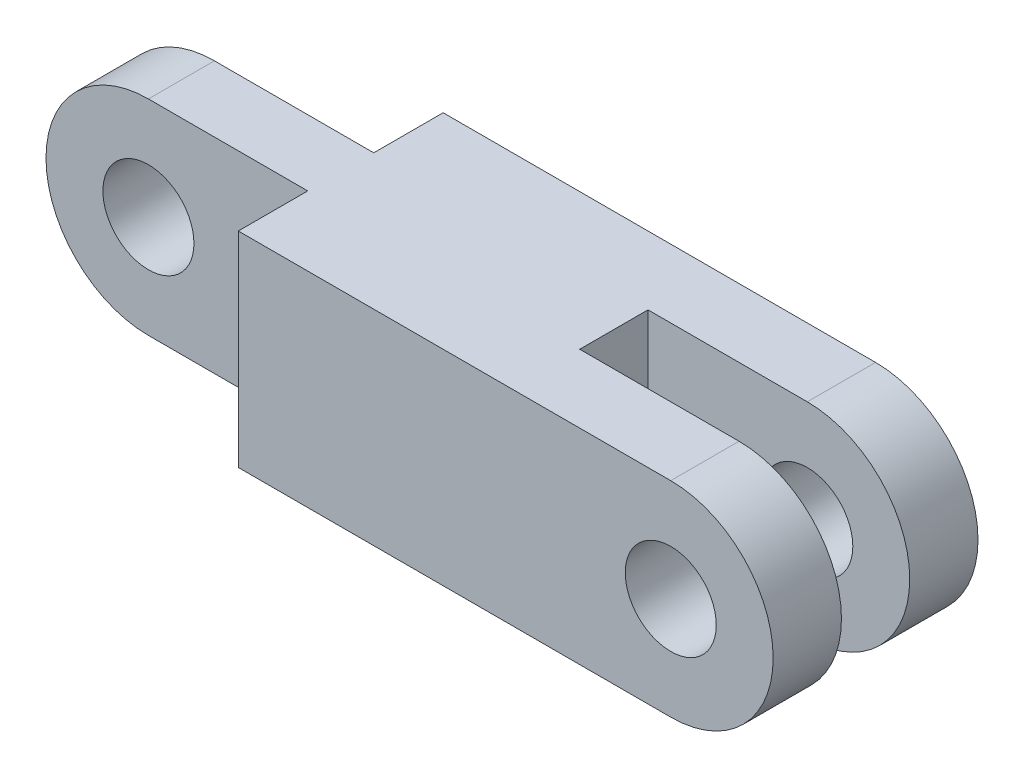
ISO-10303-21;
HEADER;
FILE_DESCRIPTION(('STEP AP214'),'2;1');
FILE_NAME('part.step','',(''),(''),'','','');
FILE_SCHEMA(('AUTOMOTIVE_DESIGN { 1 0 10303 214 1 1 1 1 }'));
ENDSEC;
DATA;
#1=APPLICATION_CONTEXT('core data for automotive mechanical design processes');
#2=APPLICATION_PROTOCOL_DEFINITION('international standard','automotive_design',2000,#1);
#3=PRODUCT_CONTEXT('',#1,'mechanical');
#4=PRODUCT('Part','Part','',(#3));
#5=PRODUCT_RELATED_PRODUCT_CATEGORY('part','',(#4));
#6=PRODUCT_DEFINITION_FORMATION('','',#4);
#7=PRODUCT_DEFINITION_CONTEXT('part definition',#1,'design');
#8=PRODUCT_DEFINITION('design','',#6,#7);
#9=PRODUCT_DEFINITION_SHAPE('','',#8);
#10=(LENGTH_UNIT() NAMED_UNIT(*) SI_UNIT(.MILLI.,.METRE.));
#11=(NAMED_UNIT(*) PLANE_ANGLE_UNIT() SI_UNIT($,.RADIAN.));
#12=(NAMED_UNIT(*) SI_UNIT($,.STERADIAN.) SOLID_ANGLE_UNIT());
#13=UNCERTAINTY_MEASURE_WITH_UNIT(LENGTH_MEASURE(1.E-05),#10,'distance_accuracy_value','');
#14=(GEOMETRIC_REPRESENTATION_CONTEXT(3) GLOBAL_UNCERTAINTY_ASSIGNED_CONTEXT((#13)) GLOBAL_UNIT_ASSIGNED_CONTEXT((#10,
#11,#12)) REPRESENTATION_CONTEXT('',''));
#15=CARTESIAN_POINT('',(0.,0.,0.));
#16=DIRECTION('',(0.,0.,1.));
#17=DIRECTION('',(1.,0.,0.));
#18=AXIS2_PLACEMENT_3D('',#15,#16,#17);
#19=CARTESIAN_POINT('',(0.,22.5,-7.25));
#20=DIRECTION('',(0.,1.,0.));
#21=DIRECTION('',(-1.,0.,0.));
#22=AXIS2_PLACEMENT_3D('',#19,#20,#21);
#23=PLANE('',#22);
#24=DIRECTION('',(0.,0.,1.));
#25=VECTOR('',#24,1.);
#26=CARTESIAN_POINT('',(-35.,22.5,-7.25));
#27=LINE('',#26,#25);
#28=CARTESIAN_POINT('',(-35.,22.5,-7.25));
#29=VERTEX_POINT('',#28);
#30=CARTESIAN_POINT('',(-35.,22.5,7.25));
#31=VERTEX_POINT('',#30);
#32=EDGE_CURVE('E36',#29,#31,#27,.T.);
#33=ORIENTED_EDGE('',*,*,#32,.T.);
#34=DIRECTION('',(-1.,0.,0.));
#35=VECTOR('',#34,1.);
#36=CARTESIAN_POINT('',(0.,22.5,7.25));
#37=LINE('',#36,#35);
#38=CARTESIAN_POINT('',(0.,22.5,7.25));
#39=VERTEX_POINT('',#38);
#40=EDGE_CURVE('E208',#39,#31,#37,.T.);
#41=ORIENTED_EDGE('',*,*,#40,.F.);
#42=DIRECTION('',(0.,0.,1.));
#43=VECTOR('',#42,1.);
#44=CARTESIAN_POINT('',(0.,22.5,22.5));
#45=LINE('',#44,#43);
#46=CARTESIAN_POINT('',(0.,22.5,22.5));
#47=VERTEX_POINT('',#46);
#48=EDGE_CURVE('E192',#39,#47,#45,.T.);
#49=ORIENTED_EDGE('',*,*,#48,.T.);
#50=DIRECTION('',(-1.,0.,0.));
#51=VECTOR('',#50,1.);
#52=CARTESIAN_POINT('',(60.,22.5,22.5));
#53=LINE('',#52,#51);
#54=CARTESIAN_POINT('',(95.,22.5,22.5));
#55=VERTEX_POINT('',#54);
#56=EDGE_CURVE('E136',#55,#47,#53,.T.);
#57=ORIENTED_EDGE('',*,*,#56,.F.);
#58=DIRECTION('',(0.,0.,-1.));
#59=VECTOR('',#58,1.);
#60=CARTESIAN_POINT('',(95.,22.5,22.5));
#61=LINE('',#60,#59);
#62=CARTESIAN_POINT('',(95.,22.5,7.5));
#63=VERTEX_POINT('',#62);
#64=EDGE_CURVE('E171',#55,#63,#61,.T.);
#65=ORIENTED_EDGE('',*,*,#64,.T.);
#66=DIRECTION('',(-1.,0.,0.));
#67=VECTOR('',#66,1.);
#68=CARTESIAN_POINT('',(95.,22.5,7.5));
#69=LINE('',#68,#67);
#70=CARTESIAN_POINT('',(60.,22.5,7.5));
#71=VERTEX_POINT('',#70);
#72=EDGE_CURVE('E165',#63,#71,#69,.T.);
#73=ORIENTED_EDGE('',*,*,#72,.T.);
#74=DIRECTION('',(0.,0.,1.));
#75=VECTOR('',#74,1.);
#76=CARTESIAN_POINT('',(60.,22.5,22.5));
#77=LINE('',#76,#75);
#78=CARTESIAN_POINT('',(60.,22.5,-7.49999999999999));
#79=VERTEX_POINT('',#78);
#80=EDGE_CURVE('E184',#79,#71,#77,.T.);
#81=ORIENTED_EDGE('',*,*,#80,.F.);
#82=DIRECTION('',(-1.,0.,0.));
#83=VECTOR('',#82,1.);
#84=CARTESIAN_POINT('',(95.,22.5,-7.5));
#85=LINE('',#84,#83);
#86=CARTESIAN_POINT('',(95.,22.5,-7.5));
#87=VERTEX_POINT('',#86);
#88=EDGE_CURVE('E47',#87,#79,#85,.T.);
#89=ORIENTED_EDGE('',*,*,#88,.F.);
#90=DIRECTION('',(0.,0.,1.));
#91=VECTOR('',#90,1.);
#92=CARTESIAN_POINT('',(95.,22.5,-22.5));
#93=LINE('',#92,#91);
#94=CARTESIAN_POINT('',(95.,22.5,-22.5));
#95=VERTEX_POINT('',#94);
#96=EDGE_CURVE('E138',#95,#87,#93,.T.);
#97=ORIENTED_EDGE('',*,*,#96,.F.);
#98=DIRECTION('',(-1.,0.,0.));
#99=VECTOR('',#98,1.);
#100=CARTESIAN_POINT('',(60.,22.5,-22.5));
#101=LINE('',#100,#99);
#102=CARTESIAN_POINT('',(0.,22.5,-22.5));
#103=VERTEX_POINT('',#102);
#104=EDGE_CURVE('E124',#95,#103,#101,.T.);
#105=ORIENTED_EDGE('',*,*,#104,.T.);
#106=CARTESIAN_POINT('',(0.,22.5,-7.24999999999999));
#107=VERTEX_POINT('',#106);
#108=EDGE_CURVE('E193',#103,#107,#45,.T.);
#109=ORIENTED_EDGE('',*,*,#108,.T.);
#110=DIRECTION('',(-1.,0.,0.));
#111=VECTOR('',#110,1.);
#112=CARTESIAN_POINT('',(0.,22.5,-7.25));
#113=LINE('',#112,#111);
#114=EDGE_CURVE('E221',#107,#29,#113,.T.);
#115=ORIENTED_EDGE('',*,*,#114,.T.);
#116=EDGE_LOOP('',(#33,#41,#49,#57,#65,#73,#81,#89,#97,#105,#109,#115));
#117=FACE_BOUND('',#116,.T.);
#118=ADVANCED_FACE('F33',(#117),#23,.T.);
#119=CARTESIAN_POINT('',(0.,-22.5,-7.25));
#120=DIRECTION('',(0.,-1.,0.));
#121=DIRECTION('',(1.,0.,0.));
#122=AXIS2_PLACEMENT_3D('',#119,#120,#121);
#123=PLANE('',#122);
#124=DIRECTION('',(1.,0.,0.));
#125=VECTOR('',#124,1.);
#126=CARTESIAN_POINT('',(0.,-22.5,-7.25));
#127=LINE('',#126,#125);
#128=CARTESIAN_POINT('',(-35.,-22.5,-7.25));
#129=VERTEX_POINT('',#128);
#130=CARTESIAN_POINT('',(0.,-22.5,-7.25));
#131=VERTEX_POINT('',#130);
#132=EDGE_CURVE('E227',#129,#131,#127,.T.);
#133=ORIENTED_EDGE('',*,*,#132,.T.);
#134=DIRECTION('',(0.,0.,-1.));
#135=VECTOR('',#134,1.);
#136=CARTESIAN_POINT('',(0.,-22.5,22.5));
#137=LINE('',#136,#135);
#138=CARTESIAN_POINT('',(0.,-22.5,-22.5));
#139=VERTEX_POINT('',#138);
#140=EDGE_CURVE('E197',#131,#139,#137,.T.);
#141=ORIENTED_EDGE('',*,*,#140,.T.);
#142=DIRECTION('',(-1.,0.,0.));
#143=VECTOR('',#142,1.);
#144=CARTESIAN_POINT('',(60.,-22.5,-22.5));
#145=LINE('',#144,#143);
#146=CARTESIAN_POINT('',(95.,-22.5,-22.5));
#147=VERTEX_POINT('',#146);
#148=EDGE_CURVE('E190',#147,#139,#145,.T.);
#149=ORIENTED_EDGE('',*,*,#148,.F.);
#150=DIRECTION('',(0.,0.,1.));
#151=VECTOR('',#150,1.);
#152=CARTESIAN_POINT('',(95.,-22.5,-22.5));
#153=LINE('',#152,#151);
#154=CARTESIAN_POINT('',(95.,-22.5,-7.5));
#155=VERTEX_POINT('',#154);
#156=EDGE_CURVE('E143',#147,#155,#153,.T.);
#157=ORIENTED_EDGE('',*,*,#156,.T.);
#158=DIRECTION('',(1.,0.,0.));
#159=VECTOR('',#158,1.);
#160=CARTESIAN_POINT('',(60.,-22.5,-7.5));
#161=LINE('',#160,#159);
#162=CARTESIAN_POINT('',(60.,-22.5,-7.5));
#163=VERTEX_POINT('',#162);
#164=EDGE_CURVE('E150',#163,#155,#161,.T.);
#165=ORIENTED_EDGE('',*,*,#164,.F.);
#166=DIRECTION('',(0.,0.,-1.));
#167=VECTOR('',#166,1.);
#168=CARTESIAN_POINT('',(60.,-22.5,22.5));
#169=LINE('',#168,#167);
#170=CARTESIAN_POINT('',(60.,-22.5,7.5));
#171=VERTEX_POINT('',#170);
#172=EDGE_CURVE('E186',#171,#163,#169,.T.);
#173=ORIENTED_EDGE('',*,*,#172,.F.);
#174=DIRECTION('',(1.,0.,0.));
#175=VECTOR('',#174,1.);
#176=CARTESIAN_POINT('',(60.,-22.5,7.5));
#177=LINE('',#176,#175);
#178=CARTESIAN_POINT('',(95.,-22.5,7.5));
#179=VERTEX_POINT('',#178);
#180=EDGE_CURVE('E55',#171,#179,#177,.T.);
#181=ORIENTED_EDGE('',*,*,#180,.T.);
#182=DIRECTION('',(0.,0.,-1.));
#183=VECTOR('',#182,1.);
#184=CARTESIAN_POINT('',(95.,-22.5,22.5));
#185=LINE('',#184,#183);
#186=CARTESIAN_POINT('',(95.,-22.5,22.5));
#187=VERTEX_POINT('',#186);
#188=EDGE_CURVE('E181',#187,#179,#185,.T.);
#189=ORIENTED_EDGE('',*,*,#188,.F.);
#190=DIRECTION('',(-1.,0.,0.));
#191=VECTOR('',#190,1.);
#192=CARTESIAN_POINT('',(60.,-22.5,22.5));
#193=LINE('',#192,#191);
#194=CARTESIAN_POINT('',(0.,-22.5,22.5));
#195=VERTEX_POINT('',#194);
#196=EDGE_CURVE('E201',#187,#195,#193,.T.);
#197=ORIENTED_EDGE('',*,*,#196,.T.);
#198=CARTESIAN_POINT('',(0.,-22.5,7.25));
#199=VERTEX_POINT('',#198);
#200=EDGE_CURVE('E187',#195,#199,#137,.T.);
#201=ORIENTED_EDGE('',*,*,#200,.T.);
#202=DIRECTION('',(1.,0.,0.));
#203=VECTOR('',#202,1.);
#204=CARTESIAN_POINT('',(0.,-22.5,7.25));
#205=LINE('',#204,#203);
#206=CARTESIAN_POINT('',(-35.,-22.5,7.25));
#207=VERTEX_POINT('',#206);
#208=EDGE_CURVE('E214',#207,#199,#205,.T.);
#209=ORIENTED_EDGE('',*,*,#208,.F.);
#210=DIRECTION('',(0.,0.,1.));
#211=VECTOR('',#210,1.);
#212=CARTESIAN_POINT('',(-35.,-22.5,-7.25));
#213=LINE('',#212,#211);
#214=EDGE_CURVE('E11',#129,#207,#213,.T.);
#215=ORIENTED_EDGE('',*,*,#214,.F.);
#216=EDGE_LOOP('',(#133,#141,#149,#157,#165,#173,#181,#189,#197,#201,#209,#215));
#217=FACE_BOUND('',#216,.T.);
#218=ADVANCED_FACE('F250',(#217),#123,.T.);
#219=CARTESIAN_POINT('',(-35.,0.,-7.25));
#220=DIRECTION('',(0.,0.,1.));
#221=DIRECTION('',(1.,0.,0.));
#222=AXIS2_PLACEMENT_3D('',#219,#220,#221);
#223=CYLINDRICAL_SURFACE('',#222,22.5);
#224=ORIENTED_EDGE('',*,*,#214,.T.);
#225=CARTESIAN_POINT('',(-35.,0.,7.25));
#226=DIRECTION('',(0.,0.,1.));
#227=DIRECTION('',(1.,0.,0.));
#228=AXIS2_PLACEMENT_3D('',#225,#226,#227);
#229=CIRCLE('',#228,22.5);
#230=EDGE_CURVE('E211',#31,#207,#229,.T.);
#231=ORIENTED_EDGE('',*,*,#230,.F.);
#232=ORIENTED_EDGE('',*,*,#32,.F.);
#233=CARTESIAN_POINT('',(-35.,0.,-7.25));
#234=DIRECTION('',(0.,0.,1.));
#235=DIRECTION('',(1.,0.,0.));
#236=AXIS2_PLACEMENT_3D('',#233,#234,#235);
#237=CIRCLE('',#236,22.5);
#238=EDGE_CURVE('E224',#29,#129,#237,.T.);
#239=ORIENTED_EDGE('',*,*,#238,.T.);
#240=EDGE_LOOP('',(#224,#231,#232,#239));
#241=FACE_BOUND('',#240,.T.);
#242=ADVANCED_FACE('F239',(#241),#223,.T.);
#243=CARTESIAN_POINT('',(-35.,0.,-7.25));
#244=DIRECTION('',(0.,0.,1.));
#245=DIRECTION('',(1.,0.,0.));
#246=AXIS2_PLACEMENT_3D('',#243,#244,#245);
#247=PLANE('',#246);
#248=CARTESIAN_POINT('',(-35.,0.,-7.25));
#249=DIRECTION('',(0.,0.,1.));
#250=DIRECTION('',(1.,0.,0.));
#251=AXIS2_PLACEMENT_3D('',#248,#249,#250);
#252=CIRCLE('',#251,10.);
#253=CARTESIAN_POINT('',(-25.,0.,-7.25));
#254=VERTEX_POINT('',#253);
#255=EDGE_CURVE('E218',#254,#254,#252,.T.);
#256=ORIENTED_EDGE('',*,*,#255,.T.);
#257=EDGE_LOOP('',(#256));
#258=FACE_BOUND('',#257,.T.);
#259=ORIENTED_EDGE('',*,*,#114,.F.);
#260=DIRECTION('',(0.,1.,0.));
#261=VECTOR('',#260,1.);
#262=CARTESIAN_POINT('',(0.,22.5,-7.25));
#263=LINE('',#262,#261);
#264=EDGE_CURVE('E229',#131,#107,#263,.T.);
#265=ORIENTED_EDGE('',*,*,#264,.F.);
#266=ORIENTED_EDGE('',*,*,#132,.F.);
#267=ORIENTED_EDGE('',*,*,#238,.F.);
#268=EDGE_LOOP('',(#259,#265,#266,#267));
#269=FACE_BOUND('',#268,.T.);
#270=ADVANCED_FACE('F286',(#258,#269),#247,.F.);
#271=CARTESIAN_POINT('',(-35.,0.,-7.25));
#272=DIRECTION('',(0.,0.,1.));
#273=DIRECTION('',(1.,0.,0.));
#274=AXIS2_PLACEMENT_3D('',#271,#272,#273);
#275=CYLINDRICAL_SURFACE('',#274,10.);
#276=ORIENTED_EDGE('',*,*,#255,.F.);
#277=EDGE_LOOP('',(#276));
#278=FACE_BOUND('',#277,.T.);
#279=CARTESIAN_POINT('',(-35.,0.,7.25));
#280=DIRECTION('',(0.,0.,1.));
#281=DIRECTION('',(1.,0.,0.));
#282=AXIS2_PLACEMENT_3D('',#279,#280,#281);
#283=CIRCLE('',#282,10.);
#284=CARTESIAN_POINT('',(-25.,0.,7.25));
#285=VERTEX_POINT('',#284);
#286=EDGE_CURVE('E135',#285,#285,#283,.T.);
#287=ORIENTED_EDGE('',*,*,#286,.T.);
#288=EDGE_LOOP('',(#287));
#289=FACE_BOUND('',#288,.T.);
#290=ADVANCED_FACE('F290',(#278,#289),#275,.F.);
#291=CARTESIAN_POINT('',(-35.,0.,7.25));
#292=DIRECTION('',(0.,0.,1.));
#293=DIRECTION('',(1.,0.,0.));
#294=AXIS2_PLACEMENT_3D('',#291,#292,#293);
#295=PLANE('',#294);
#296=ORIENTED_EDGE('',*,*,#40,.T.);
#297=ORIENTED_EDGE('',*,*,#230,.T.);
#298=ORIENTED_EDGE('',*,*,#208,.T.);
#299=DIRECTION('',(0.,1.,0.));
#300=VECTOR('',#299,1.);
#301=CARTESIAN_POINT('',(0.,22.5,7.25));
#302=LINE('',#301,#300);
#303=EDGE_CURVE('E216',#199,#39,#302,.T.);
#304=ORIENTED_EDGE('',*,*,#303,.T.);
#305=EDGE_LOOP('',(#296,#297,#298,#304));
#306=FACE_BOUND('',#305,.T.);
#307=ORIENTED_EDGE('',*,*,#286,.F.);
#308=EDGE_LOOP('',(#307));
#309=FACE_BOUND('',#308,.T.);
#310=ADVANCED_FACE('F242',(#306,#309),#295,.T.);
#311=CARTESIAN_POINT('',(0.,0.,0.));
#312=DIRECTION('',(-1.,0.,0.));
#313=DIRECTION('',(0.,-1.,0.));
#314=AXIS2_PLACEMENT_3D('',#311,#312,#313);
#315=PLANE('',#314);
#316=ORIENTED_EDGE('',*,*,#303,.F.);
#317=ORIENTED_EDGE('',*,*,#200,.F.);
#318=DIRECTION('',(0.,-1.,0.));
#319=VECTOR('',#318,1.);
#320=CARTESIAN_POINT('',(0.,-22.5,22.5));
#321=LINE('',#320,#319);
#322=EDGE_CURVE('E195',#47,#195,#321,.T.);
#323=ORIENTED_EDGE('',*,*,#322,.F.);
#324=ORIENTED_EDGE('',*,*,#48,.F.);
#325=EDGE_LOOP('',(#316,#317,#323,#324));
#326=FACE_BOUND('',#325,.T.);
#327=ADVANCED_FACE('F247',(#326),#315,.T.);
#328=CARTESIAN_POINT('',(60.,-22.5,-22.5));
#329=DIRECTION('',(0.,0.,1.));
#330=DIRECTION('',(1.,0.,0.));
#331=AXIS2_PLACEMENT_3D('',#328,#329,#330);
#332=PLANE('',#331);
#333=DIRECTION('',(0.,1.,0.));
#334=VECTOR('',#333,1.);
#335=CARTESIAN_POINT('',(0.,-22.5,-22.5));
#336=LINE('',#335,#334);
#337=EDGE_CURVE('E132',#139,#103,#336,.T.);
#338=ORIENTED_EDGE('',*,*,#337,.T.);
#339=ORIENTED_EDGE('',*,*,#104,.F.);
#340=CARTESIAN_POINT('',(95.,0.,-22.5));
#341=DIRECTION('',(0.,0.,1.));
#342=DIRECTION('',(-1.,0.,0.));
#343=AXIS2_PLACEMENT_3D('',#340,#341,#342);
#344=CIRCLE('',#343,22.5);
#345=EDGE_CURVE('E130',#147,#95,#344,.T.);
#346=ORIENTED_EDGE('',*,*,#345,.F.);
#347=ORIENTED_EDGE('',*,*,#148,.T.);
#348=EDGE_LOOP('',(#338,#339,#346,#347));
#349=FACE_BOUND('',#348,.T.);
#350=CARTESIAN_POINT('',(95.,0.,-22.5));
#351=DIRECTION('',(0.,0.,1.));
#352=DIRECTION('',(1.,0.,0.));
#353=AXIS2_PLACEMENT_3D('',#350,#351,#352);
#354=CIRCLE('',#353,9.99999999999999);
#355=CARTESIAN_POINT('',(105.,0.,-22.5));
#356=VERTEX_POINT('',#355);
#357=EDGE_CURVE('E158',#356,#356,#354,.T.);
#358=ORIENTED_EDGE('',*,*,#357,.T.);
#359=EDGE_LOOP('',(#358));
#360=FACE_BOUND('',#359,.T.);
#361=ADVANCED_FACE('F126',(#349,#360),#332,.F.);
#362=CARTESIAN_POINT('',(60.,-22.5,22.5));
#363=DIRECTION('',(0.,0.,-1.));
#364=DIRECTION('',(-1.,0.,0.));
#365=AXIS2_PLACEMENT_3D('',#362,#363,#364);
#366=PLANE('',#365);
#367=ORIENTED_EDGE('',*,*,#322,.T.);
#368=ORIENTED_EDGE('',*,*,#196,.F.);
#369=CARTESIAN_POINT('',(95.,0.,22.5));
#370=DIRECTION('',(0.,0.,1.));
#371=DIRECTION('',(-1.,0.,0.));
#372=AXIS2_PLACEMENT_3D('',#369,#370,#371);
#373=CIRCLE('',#372,22.5);
#374=EDGE_CURVE('E168',#187,#55,#373,.T.);
#375=ORIENTED_EDGE('',*,*,#374,.T.);
#376=ORIENTED_EDGE('',*,*,#56,.T.);
#377=EDGE_LOOP('',(#367,#368,#375,#376));
#378=FACE_BOUND('',#377,.T.);
#379=CARTESIAN_POINT('',(95.,0.,22.5));
#380=DIRECTION('',(0.,0.,1.));
#381=DIRECTION('',(1.,0.,0.));
#382=AXIS2_PLACEMENT_3D('',#379,#380,#381);
#383=CIRCLE('',#382,9.99999999999999);
#384=CARTESIAN_POINT('',(105.,0.,22.5));
#385=VERTEX_POINT('',#384);
#386=EDGE_CURVE('E162',#385,#385,#383,.T.);
#387=ORIENTED_EDGE('',*,*,#386,.F.);
#388=EDGE_LOOP('',(#387));
#389=FACE_BOUND('',#388,.T.);
#390=ADVANCED_FACE('F254',(#378,#389),#366,.F.);
#391=CARTESIAN_POINT('',(60.,0.,0.));
#392=DIRECTION('',(-1.,0.,0.));
#393=DIRECTION('',(0.,-1.,0.));
#394=AXIS2_PLACEMENT_3D('',#391,#392,#393);
#395=PLANE('',#394);
#396=ORIENTED_EDGE('',*,*,#172,.T.);
#397=DIRECTION('',(0.,-1.,0.));
#398=VECTOR('',#397,1.);
#399=CARTESIAN_POINT('',(60.,22.5,-7.5));
#400=LINE('',#399,#398);
#401=EDGE_CURVE('E147',#79,#163,#400,.T.);
#402=ORIENTED_EDGE('',*,*,#401,.F.);
#403=ORIENTED_EDGE('',*,*,#80,.T.);
#404=DIRECTION('',(0.,-1.,0.));
#405=VECTOR('',#404,1.);
#406=CARTESIAN_POINT('',(60.,22.5,7.5));
#407=LINE('',#406,#405);
#408=EDGE_CURVE('E175',#71,#171,#407,.T.);
#409=ORIENTED_EDGE('',*,*,#408,.T.);
#410=EDGE_LOOP('',(#396,#402,#403,#409));
#411=FACE_BOUND('',#410,.T.);
#412=ADVANCED_FACE('F263',(#411),#395,.F.);
#413=ORIENTED_EDGE('',*,*,#140,.F.);
#414=ORIENTED_EDGE('',*,*,#264,.T.);
#415=ORIENTED_EDGE('',*,*,#108,.F.);
#416=ORIENTED_EDGE('',*,*,#337,.F.);
#417=EDGE_LOOP('',(#413,#414,#415,#416));
#418=FACE_BOUND('',#417,.T.);
#419=ADVANCED_FACE('F301',(#418),#315,.T.);
#420=CARTESIAN_POINT('',(95.,0.,7.5));
#421=DIRECTION('',(0.,0.,-1.));
#422=DIRECTION('',(-1.,0.,0.));
#423=AXIS2_PLACEMENT_3D('',#420,#421,#422);
#424=PLANE('',#423);
#425=ORIENTED_EDGE('',*,*,#72,.F.);
#426=CARTESIAN_POINT('',(95.,0.,7.5));
#427=DIRECTION('',(0.,0.,1.));
#428=DIRECTION('',(-1.,0.,0.));
#429=AXIS2_PLACEMENT_3D('',#426,#427,#428);
#430=CIRCLE('',#429,22.5);
#431=EDGE_CURVE('E172',#179,#63,#430,.T.);
#432=ORIENTED_EDGE('',*,*,#431,.F.);
#433=ORIENTED_EDGE('',*,*,#180,.F.);
#434=ORIENTED_EDGE('',*,*,#408,.F.);
#435=EDGE_LOOP('',(#425,#432,#433,#434));
#436=FACE_BOUND('',#435,.T.);
#437=CARTESIAN_POINT('',(95.,0.,7.5));
#438=DIRECTION('',(0.,0.,1.));
#439=DIRECTION('',(1.,0.,0.));
#440=AXIS2_PLACEMENT_3D('',#437,#438,#439);
#441=CIRCLE('',#440,9.99999999999999);
#442=CARTESIAN_POINT('',(105.,0.,7.5));
#443=VERTEX_POINT('',#442);
#444=EDGE_CURVE('E142',#443,#443,#441,.T.);
#445=ORIENTED_EDGE('',*,*,#444,.T.);
#446=EDGE_LOOP('',(#445));
#447=FACE_BOUND('',#446,.T.);
#448=ADVANCED_FACE('F259',(#436,#447),#424,.T.);
#449=CARTESIAN_POINT('',(95.,0.,22.5));
#450=DIRECTION('',(0.,0.,-1.));
#451=DIRECTION('',(-1.,0.,0.));
#452=AXIS2_PLACEMENT_3D('',#449,#450,#451);
#453=CYLINDRICAL_SURFACE('',#452,22.5);
#454=ORIENTED_EDGE('',*,*,#431,.T.);
#455=ORIENTED_EDGE('',*,*,#64,.F.);
#456=ORIENTED_EDGE('',*,*,#374,.F.);
#457=ORIENTED_EDGE('',*,*,#188,.T.);
#458=EDGE_LOOP('',(#454,#455,#456,#457));
#459=FACE_BOUND('',#458,.T.);
#460=ADVANCED_FACE('F306',(#459),#453,.T.);
#461=CARTESIAN_POINT('',(95.,0.,22.5));
#462=DIRECTION('',(0.,0.,-1.));
#463=DIRECTION('',(-1.,0.,0.));
#464=AXIS2_PLACEMENT_3D('',#461,#462,#463);
#465=CYLINDRICAL_SURFACE('',#464,9.99999999999999);
#466=ORIENTED_EDGE('',*,*,#386,.T.);
#467=EDGE_LOOP('',(#466));
#468=FACE_BOUND('',#467,.T.);
#469=ORIENTED_EDGE('',*,*,#444,.F.);
#470=EDGE_LOOP('',(#469));
#471=FACE_BOUND('',#470,.T.);
#472=ADVANCED_FACE('F275',(#468,#471),#465,.F.);
#473=CARTESIAN_POINT('',(95.,0.,-22.5));
#474=DIRECTION('',(0.,0.,1.));
#475=DIRECTION('',(1.,0.,0.));
#476=AXIS2_PLACEMENT_3D('',#473,#474,#475);
#477=CYLINDRICAL_SURFACE('',#476,22.5);
#478=CARTESIAN_POINT('',(95.,0.,-7.5));
#479=DIRECTION('',(0.,0.,1.));
#480=DIRECTION('',(-1.,0.,0.));
#481=AXIS2_PLACEMENT_3D('',#478,#479,#480);
#482=CIRCLE('',#481,22.5);
#483=EDGE_CURVE('E157',#155,#87,#482,.T.);
#484=ORIENTED_EDGE('',*,*,#483,.F.);
#485=ORIENTED_EDGE('',*,*,#156,.F.);
#486=ORIENTED_EDGE('',*,*,#345,.T.);
#487=ORIENTED_EDGE('',*,*,#96,.T.);
#488=EDGE_LOOP('',(#484,#485,#486,#487));
#489=FACE_BOUND('',#488,.T.);
#490=ADVANCED_FACE('F146',(#489),#477,.T.);
#491=CARTESIAN_POINT('',(95.,0.,-7.5));
#492=DIRECTION('',(0.,0.,1.));
#493=DIRECTION('',(-1.,0.,0.));
#494=AXIS2_PLACEMENT_3D('',#491,#492,#493);
#495=PLANE('',#494);
#496=CARTESIAN_POINT('',(95.,0.,-7.5));
#497=DIRECTION('',(0.,0.,1.));
#498=DIRECTION('',(1.,0.,0.));
#499=AXIS2_PLACEMENT_3D('',#496,#497,#498);
#500=CIRCLE('',#499,9.99999999999999);
#501=CARTESIAN_POINT('',(105.,0.,-7.5));
#502=VERTEX_POINT('',#501);
#503=EDGE_CURVE('E154',#502,#502,#500,.T.);
#504=ORIENTED_EDGE('',*,*,#503,.F.);
#505=EDGE_LOOP('',(#504));
#506=FACE_BOUND('',#505,.T.);
#507=ORIENTED_EDGE('',*,*,#88,.T.);
#508=ORIENTED_EDGE('',*,*,#401,.T.);
#509=ORIENTED_EDGE('',*,*,#164,.T.);
#510=ORIENTED_EDGE('',*,*,#483,.T.);
#511=EDGE_LOOP('',(#507,#508,#509,#510));
#512=FACE_BOUND('',#511,.T.);
#513=ADVANCED_FACE('F264',(#506,#512),#495,.T.);
#514=CARTESIAN_POINT('',(95.,0.,-22.5));
#515=DIRECTION('',(0.,0.,1.));
#516=DIRECTION('',(1.,0.,0.));
#517=AXIS2_PLACEMENT_3D('',#514,#515,#516);
#518=CYLINDRICAL_SURFACE('',#517,9.99999999999999);
#519=ORIENTED_EDGE('',*,*,#357,.F.);
#520=EDGE_LOOP('',(#519));
#521=FACE_BOUND('',#520,.T.);
#522=ORIENTED_EDGE('',*,*,#503,.T.);
#523=EDGE_LOOP('',(#522));
#524=FACE_BOUND('',#523,.T.);
#525=ADVANCED_FACE('F266',(#521,#524),#518,.F.);
#526=CLOSED_SHELL('',(#118,#218,#242,#270,#290,#310,#327,#361,#390,#412,#419,#448,#460,#472,
#490,#513,#525));
#527=MANIFOLD_SOLID_BREP('B2',#526);
#528=ADVANCED_BREP_SHAPE_REPRESENTATION('',(#18,#527),#14);
#529=SHAPE_DEFINITION_REPRESENTATION(#9,#528);
ENDSEC;
END-ISO-10303-21;
